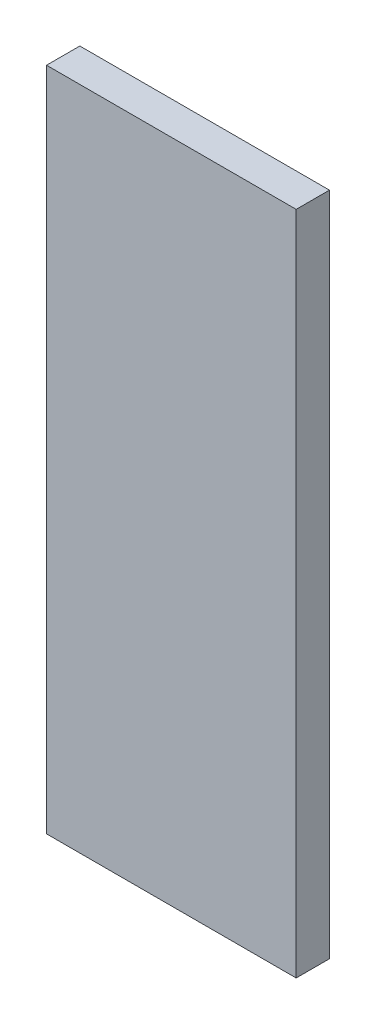
ISO-10303-21;
HEADER;
FILE_DESCRIPTION(('STEP AP214'),'2;1');
FILE_NAME('part.step','',(''),(''),'','','');
FILE_SCHEMA(('AUTOMOTIVE_DESIGN { 1 0 10303 214 1 1 1 1 }'));
ENDSEC;
DATA;
#1=APPLICATION_CONTEXT('core data for automotive mechanical design processes');
#2=APPLICATION_PROTOCOL_DEFINITION('international standard','automotive_design',2000,#1);
#3=PRODUCT_CONTEXT('',#1,'mechanical');
#4=PRODUCT('Part','Part','',(#3));
#5=PRODUCT_RELATED_PRODUCT_CATEGORY('part','',(#4));
#6=PRODUCT_DEFINITION_FORMATION('','',#4);
#7=PRODUCT_DEFINITION_CONTEXT('part definition',#1,'design');
#8=PRODUCT_DEFINITION('design','',#6,#7);
#9=PRODUCT_DEFINITION_SHAPE('','',#8);
#10=(LENGTH_UNIT() NAMED_UNIT(*) SI_UNIT(.MILLI.,.METRE.));
#11=(NAMED_UNIT(*) PLANE_ANGLE_UNIT() SI_UNIT($,.RADIAN.));
#12=(NAMED_UNIT(*) SI_UNIT($,.STERADIAN.) SOLID_ANGLE_UNIT());
#13=UNCERTAINTY_MEASURE_WITH_UNIT(LENGTH_MEASURE(1.E-05),#10,'distance_accuracy_value','');
#14=(GEOMETRIC_REPRESENTATION_CONTEXT(3) GLOBAL_UNCERTAINTY_ASSIGNED_CONTEXT((#13)) GLOBAL_UNIT_ASSIGNED_CONTEXT((#10,
#11,#12)) REPRESENTATION_CONTEXT('',''));
#15=CARTESIAN_POINT('',(0.,0.,0.));
#16=DIRECTION('',(0.,0.,1.));
#17=DIRECTION('',(1.,0.,0.));
#18=AXIS2_PLACEMENT_3D('',#15,#16,#17);
#19=CARTESIAN_POINT('',(15.,40.,4.));
#20=DIRECTION('',(-1.,0.,0.));
#21=DIRECTION('',(0.,-1.,0.));
#22=AXIS2_PLACEMENT_3D('',#19,#20,#21);
#23=PLANE('',#22);
#24=DIRECTION('',(0.,1.,0.));
#25=VECTOR('',#24,1.);
#26=CARTESIAN_POINT('',(15.,40.,0.));
#27=LINE('',#26,#25);
#28=CARTESIAN_POINT('',(15.,-40.,0.));
#29=VERTEX_POINT('',#28);
#30=CARTESIAN_POINT('',(15.,40.,0.));
#31=VERTEX_POINT('',#30);
#32=EDGE_CURVE('E101',#29,#31,#27,.T.);
#33=ORIENTED_EDGE('',*,*,#32,.T.);
#34=DIRECTION('',(0.,0.,-1.));
#35=VECTOR('',#34,1.);
#36=CARTESIAN_POINT('',(15.,40.,4.));
#37=LINE('',#36,#35);
#38=CARTESIAN_POINT('',(15.,40.,4.));
#39=VERTEX_POINT('',#38);
#40=EDGE_CURVE('E11',#39,#31,#37,.T.);
#41=ORIENTED_EDGE('',*,*,#40,.F.);
#42=DIRECTION('',(0.,1.,0.));
#43=VECTOR('',#42,1.);
#44=CARTESIAN_POINT('',(15.,40.,4.));
#45=LINE('',#44,#43);
#46=CARTESIAN_POINT('',(15.,-40.,4.));
#47=VERTEX_POINT('',#46);
#48=EDGE_CURVE('E89',#47,#39,#45,.T.);
#49=ORIENTED_EDGE('',*,*,#48,.F.);
#50=DIRECTION('',(0.,0.,-1.));
#51=VECTOR('',#50,1.);
#52=CARTESIAN_POINT('',(15.,-40.,4.));
#53=LINE('',#52,#51);
#54=EDGE_CURVE('E97',#47,#29,#53,.T.);
#55=ORIENTED_EDGE('',*,*,#54,.T.);
#56=EDGE_LOOP('',(#33,#41,#49,#55));
#57=FACE_BOUND('',#56,.T.);
#58=ADVANCED_FACE('F38',(#57),#23,.F.);
#59=CARTESIAN_POINT('',(-15.,40.,4.));
#60=DIRECTION('',(0.,-1.,0.));
#61=DIRECTION('',(0.,0.,-1.));
#62=AXIS2_PLACEMENT_3D('',#59,#60,#61);
#63=PLANE('',#62);
#64=DIRECTION('',(-1.,0.,0.));
#65=VECTOR('',#64,1.);
#66=CARTESIAN_POINT('',(-15.,40.,0.));
#67=LINE('',#66,#65);
#68=CARTESIAN_POINT('',(-15.,40.,0.));
#69=VERTEX_POINT('',#68);
#70=EDGE_CURVE('E93',#31,#69,#67,.T.);
#71=ORIENTED_EDGE('',*,*,#70,.T.);
#72=DIRECTION('',(0.,0.,-1.));
#73=VECTOR('',#72,1.);
#74=CARTESIAN_POINT('',(-15.,40.,4.));
#75=LINE('',#74,#73);
#76=CARTESIAN_POINT('',(-15.,40.,4.));
#77=VERTEX_POINT('',#76);
#78=EDGE_CURVE('E46',#77,#69,#75,.T.);
#79=ORIENTED_EDGE('',*,*,#78,.F.);
#80=DIRECTION('',(-1.,0.,0.));
#81=VECTOR('',#80,1.);
#82=CARTESIAN_POINT('',(-15.,40.,4.));
#83=LINE('',#82,#81);
#84=EDGE_CURVE('E84',#39,#77,#83,.T.);
#85=ORIENTED_EDGE('',*,*,#84,.F.);
#86=ORIENTED_EDGE('',*,*,#40,.T.);
#87=EDGE_LOOP('',(#71,#79,#85,#86));
#88=FACE_BOUND('',#87,.T.);
#89=ADVANCED_FACE('F92',(#88),#63,.F.);
#90=CARTESIAN_POINT('',(-15.,40.,4.));
#91=DIRECTION('',(1.,0.,0.));
#92=DIRECTION('',(0.,1.,0.));
#93=AXIS2_PLACEMENT_3D('',#90,#91,#92);
#94=PLANE('',#93);
#95=DIRECTION('',(0.,-1.,0.));
#96=VECTOR('',#95,1.);
#97=CARTESIAN_POINT('',(-15.,40.,0.));
#98=LINE('',#97,#96);
#99=CARTESIAN_POINT('',(-15.,-40.,0.));
#100=VERTEX_POINT('',#99);
#101=EDGE_CURVE('E71',#69,#100,#98,.T.);
#102=ORIENTED_EDGE('',*,*,#101,.T.);
#103=DIRECTION('',(0.,0.,-1.));
#104=VECTOR('',#103,1.);
#105=CARTESIAN_POINT('',(-15.,-40.,4.));
#106=LINE('',#105,#104);
#107=CARTESIAN_POINT('',(-15.,-40.,4.));
#108=VERTEX_POINT('',#107);
#109=EDGE_CURVE('E94',#108,#100,#106,.T.);
#110=ORIENTED_EDGE('',*,*,#109,.F.);
#111=DIRECTION('',(0.,-1.,0.));
#112=VECTOR('',#111,1.);
#113=CARTESIAN_POINT('',(-15.,40.,4.));
#114=LINE('',#113,#112);
#115=EDGE_CURVE('E87',#77,#108,#114,.T.);
#116=ORIENTED_EDGE('',*,*,#115,.F.);
#117=ORIENTED_EDGE('',*,*,#78,.T.);
#118=EDGE_LOOP('',(#102,#110,#116,#117));
#119=FACE_BOUND('',#118,.T.);
#120=ADVANCED_FACE('F95',(#119),#94,.F.);
#121=CARTESIAN_POINT('',(-15.,-40.,4.));
#122=DIRECTION('',(0.,1.,0.));
#123=DIRECTION('',(0.,0.,1.));
#124=AXIS2_PLACEMENT_3D('',#121,#122,#123);
#125=PLANE('',#124);
#126=DIRECTION('',(1.,0.,0.));
#127=VECTOR('',#126,1.);
#128=CARTESIAN_POINT('',(-15.,-40.,0.));
#129=LINE('',#128,#127);
#130=EDGE_CURVE('E77',#100,#29,#129,.T.);
#131=ORIENTED_EDGE('',*,*,#130,.T.);
#132=ORIENTED_EDGE('',*,*,#54,.F.);
#133=DIRECTION('',(1.,0.,0.));
#134=VECTOR('',#133,1.);
#135=CARTESIAN_POINT('',(-15.,-40.,4.));
#136=LINE('',#135,#134);
#137=EDGE_CURVE('E54',#108,#47,#136,.T.);
#138=ORIENTED_EDGE('',*,*,#137,.F.);
#139=ORIENTED_EDGE('',*,*,#109,.T.);
#140=EDGE_LOOP('',(#131,#132,#138,#139));
#141=FACE_BOUND('',#140,.T.);
#142=ADVANCED_FACE('F108',(#141),#125,.F.);
#143=CARTESIAN_POINT('',(0.,0.,4.));
#144=DIRECTION('',(0.,0.,1.));
#145=DIRECTION('',(1.,0.,0.));
#146=AXIS2_PLACEMENT_3D('',#143,#144,#145);
#147=PLANE('',#146);
#148=ORIENTED_EDGE('',*,*,#48,.T.);
#149=ORIENTED_EDGE('',*,*,#84,.T.);
#150=ORIENTED_EDGE('',*,*,#115,.T.);
#151=ORIENTED_EDGE('',*,*,#137,.T.);
#152=EDGE_LOOP('',(#148,#149,#150,#151));
#153=FACE_BOUND('',#152,.T.);
#154=ADVANCED_FACE('F85',(#153),#147,.T.);
#155=CARTESIAN_POINT('',(0.,0.,0.));
#156=DIRECTION('',(0.,0.,1.));
#157=DIRECTION('',(1.,0.,0.));
#158=AXIS2_PLACEMENT_3D('',#155,#156,#157);
#159=PLANE('',#158);
#160=ORIENTED_EDGE('',*,*,#32,.F.);
#161=ORIENTED_EDGE('',*,*,#130,.F.);
#162=ORIENTED_EDGE('',*,*,#101,.F.);
#163=ORIENTED_EDGE('',*,*,#70,.F.);
#164=EDGE_LOOP('',(#160,#161,#162,#163));
#165=FACE_BOUND('',#164,.T.);
#166=ADVANCED_FACE('F111',(#165),#159,.F.);
#167=CLOSED_SHELL('',(#58,#89,#120,#142,#154,#166));
#168=MANIFOLD_SOLID_BREP('B2',#167);
#169=ADVANCED_BREP_SHAPE_REPRESENTATION('',(#18,#168),#14);
#170=SHAPE_DEFINITION_REPRESENTATION(#9,#169);
ENDSEC;
END-ISO-10303-21;
